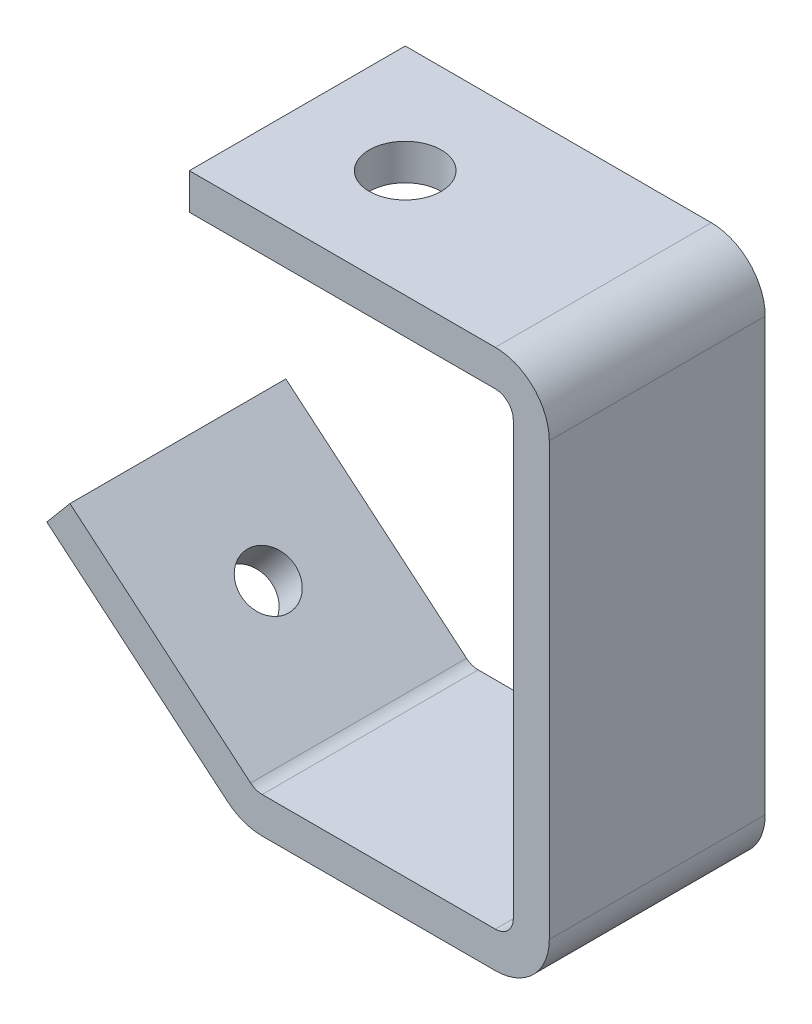
ISO-10303-21;
HEADER;
FILE_DESCRIPTION(('STEP AP214'),'2;1');
FILE_NAME('part.step','',(''),(''),'','','');
FILE_SCHEMA(('AUTOMOTIVE_DESIGN { 1 0 10303 214 1 1 1 1 }'));
ENDSEC;
DATA;
#1=APPLICATION_CONTEXT('core data for automotive mechanical design processes');
#2=APPLICATION_PROTOCOL_DEFINITION('international standard','automotive_design',2000,#1);
#3=PRODUCT_CONTEXT('',#1,'mechanical');
#4=PRODUCT('Part','Part','',(#3));
#5=PRODUCT_RELATED_PRODUCT_CATEGORY('part','',(#4));
#6=PRODUCT_DEFINITION_FORMATION('','',#4);
#7=PRODUCT_DEFINITION_CONTEXT('part definition',#1,'design');
#8=PRODUCT_DEFINITION('design','',#6,#7);
#9=PRODUCT_DEFINITION_SHAPE('','',#8);
#10=(LENGTH_UNIT() NAMED_UNIT(*) SI_UNIT(.MILLI.,.METRE.));
#11=(NAMED_UNIT(*) PLANE_ANGLE_UNIT() SI_UNIT($,.RADIAN.));
#12=(NAMED_UNIT(*) SI_UNIT($,.STERADIAN.) SOLID_ANGLE_UNIT());
#13=UNCERTAINTY_MEASURE_WITH_UNIT(LENGTH_MEASURE(1.E-05),#10,'distance_accuracy_value','');
#14=(GEOMETRIC_REPRESENTATION_CONTEXT(3) GLOBAL_UNCERTAINTY_ASSIGNED_CONTEXT((#13)) GLOBAL_UNIT_ASSIGNED_CONTEXT((#10,
#11,#12)) REPRESENTATION_CONTEXT('',''));
#15=CARTESIAN_POINT('',(0.,0.,0.));
#16=DIRECTION('',(0.,0.,1.));
#17=DIRECTION('',(1.,0.,0.));
#18=AXIS2_PLACEMENT_3D('',#15,#16,#17);
#19=CARTESIAN_POINT('',(-52.6954282662463,-40.5310213291184,38.1));
#20=DIRECTION('',(-0.642787609686535,-0.766044443118982,0.));
#21=DIRECTION('',(0.766044443118982,-0.642787609686535,0.));
#22=AXIS2_PLACEMENT_3D('',#19,#20,#21);
#23=PLANE('',#22);
#24=CARTESIAN_POINT('',(-68.6378577574194,-27.1537346230054,19.05));
#25=DIRECTION('',(-0.642787609686535,-0.766044443118982,0.));
#26=DIRECTION('',(0.766044443118982,-0.642787609686535,0.));
#27=AXIS2_PLACEMENT_3D('',#24,#25,#26);
#28=CIRCLE('',#27,4.765);
#29=CARTESIAN_POINT('',(-64.9876559859574,-30.2166175831617,19.05));
#30=VERTEX_POINT('',#29);
#31=EDGE_CURVE('E370',#30,#30,#28,.T.);
#32=ORIENTED_EDGE('',*,*,#31,.T.);
#33=EDGE_LOOP('',(#32));
#34=FACE_BOUND('',#33,.T.);
#35=DIRECTION('',(-0.766044443118982,0.642787609686535,0.));
#36=VECTOR('',#35,1.);
#37=CARTESIAN_POINT('',(-52.6954282662463,-40.5310213291184,0.));
#38=LINE('',#37,#36);
#39=CARTESIAN_POINT('',(-52.6954282662463,-40.5310213291184,0.));
#40=VERTEX_POINT('',#39);
#41=CARTESIAN_POINT('',(-84.5792426187254,-13.7773244654286,0.));
#42=VERTEX_POINT('',#41);
#43=EDGE_CURVE('E187',#40,#42,#38,.T.);
#44=ORIENTED_EDGE('',*,*,#43,.T.);
#45=DIRECTION('',(0.,0.,-1.));
#46=VECTOR('',#45,1.);
#47=CARTESIAN_POINT('',(-84.5792426187254,-13.7773244654286,38.1));
#48=LINE('',#47,#46);
#49=CARTESIAN_POINT('',(-84.5792426187254,-13.7773244654286,38.1));
#50=VERTEX_POINT('',#49);
#51=EDGE_CURVE('E11',#50,#42,#48,.T.);
#52=ORIENTED_EDGE('',*,*,#51,.F.);
#53=DIRECTION('',(-0.766044443118982,0.642787609686535,0.));
#54=VECTOR('',#53,1.);
#55=CARTESIAN_POINT('',(-52.6954282662463,-40.5310213291184,38.1));
#56=LINE('',#55,#54);
#57=CARTESIAN_POINT('',(-52.6954282662463,-40.5310213291184,38.1));
#58=VERTEX_POINT('',#57);
#59=EDGE_CURVE('E120',#58,#50,#56,.T.);
#60=ORIENTED_EDGE('',*,*,#59,.F.);
#61=DIRECTION('',(0.,0.,-1.));
#62=VECTOR('',#61,1.);
#63=CARTESIAN_POINT('',(-52.6954282662463,-40.5310213291184,38.1));
#64=LINE('',#63,#62);
#65=EDGE_CURVE('E183',#58,#40,#64,.T.);
#66=ORIENTED_EDGE('',*,*,#65,.T.);
#67=EDGE_LOOP('',(#44,#52,#60,#66));
#68=FACE_BOUND('',#67,.T.);
#69=ADVANCED_FACE('F39',(#34,#68),#23,.F.);
#70=CARTESIAN_POINT('',(-88.6609439402349,-18.6417066792342,38.1));
#71=DIRECTION('',(-0.766044443118981,0.642787609686536,0.));
#72=DIRECTION('',(-0.642787609686536,-0.766044443118981,0.));
#73=AXIS2_PLACEMENT_3D('',#70,#71,#72);
#74=PLANE('',#73);
#75=DIRECTION('',(0.642787609686536,0.766044443118981,0.));
#76=VECTOR('',#75,1.);
#77=CARTESIAN_POINT('',(-88.6609439402349,-18.6417066792342,0.));
#78=LINE('',#77,#76);
#79=CARTESIAN_POINT('',(-88.6609439402349,-18.6417066792342,0.));
#80=VERTEX_POINT('',#79);
#81=EDGE_CURVE('E191',#80,#42,#78,.T.);
#82=ORIENTED_EDGE('',*,*,#81,.F.);
#83=DIRECTION('',(0.,0.,-1.));
#84=VECTOR('',#83,1.);
#85=CARTESIAN_POINT('',(-88.6609439402349,-18.6417066792342,38.1));
#86=LINE('',#85,#84);
#87=CARTESIAN_POINT('',(-88.6609439402349,-18.6417066792342,38.1));
#88=VERTEX_POINT('',#87);
#89=EDGE_CURVE('E48',#88,#80,#86,.T.);
#90=ORIENTED_EDGE('',*,*,#89,.F.);
#91=DIRECTION('',(0.642787609686536,0.766044443118981,0.));
#92=VECTOR('',#91,1.);
#93=CARTESIAN_POINT('',(-88.6609439402349,-18.6417066792342,38.1));
#94=LINE('',#93,#92);
#95=EDGE_CURVE('E303',#88,#50,#94,.T.);
#96=ORIENTED_EDGE('',*,*,#95,.T.);
#97=ORIENTED_EDGE('',*,*,#51,.T.);
#98=EDGE_LOOP('',(#82,#90,#96,#97));
#99=FACE_BOUND('',#98,.T.);
#100=ADVANCED_FACE('F290',(#99),#74,.T.);
#101=CARTESIAN_POINT('',(-56.7771295877558,-45.3954035429239,38.1));
#102=DIRECTION('',(-0.642787609686535,-0.766044443118982,0.));
#103=DIRECTION('',(0.766044443118982,-0.642787609686535,0.));
#104=AXIS2_PLACEMENT_3D('',#101,#102,#103);
#105=PLANE('',#104);
#106=CARTESIAN_POINT('',(-72.7195590789289,-32.018116836811,19.05));
#107=DIRECTION('',(-0.642787609686535,-0.766044443118982,0.));
#108=DIRECTION('',(0.766044443118982,-0.642787609686535,0.));
#109=AXIS2_PLACEMENT_3D('',#106,#107,#108);
#110=CIRCLE('',#109,4.765);
#111=CARTESIAN_POINT('',(-69.0693573074669,-35.0809997969673,19.05));
#112=VERTEX_POINT('',#111);
#113=EDGE_CURVE('E374',#112,#112,#110,.T.);
#114=ORIENTED_EDGE('',*,*,#113,.F.);
#115=EDGE_LOOP('',(#114));
#116=FACE_BOUND('',#115,.T.);
#117=DIRECTION('',(-0.766044443118982,0.642787609686535,0.));
#118=VECTOR('',#117,1.);
#119=CARTESIAN_POINT('',(-56.7771295877558,-45.3954035429239,0.));
#120=LINE('',#119,#118);
#121=CARTESIAN_POINT('',(-56.7771295877558,-45.3954035429239,0.));
#122=VERTEX_POINT('',#121);
#123=EDGE_CURVE('E196',#122,#80,#120,.T.);
#124=ORIENTED_EDGE('',*,*,#123,.F.);
#125=DIRECTION('',(0.,0.,-1.));
#126=VECTOR('',#125,1.);
#127=CARTESIAN_POINT('',(-56.7771295877558,-45.3954035429239,38.1));
#128=LINE('',#127,#126);
#129=CARTESIAN_POINT('',(-56.7771295877558,-45.3954035429239,38.1));
#130=VERTEX_POINT('',#129);
#131=EDGE_CURVE('E278',#130,#122,#128,.T.);
#132=ORIENTED_EDGE('',*,*,#131,.F.);
#133=DIRECTION('',(-0.766044443118982,0.642787609686535,0.));
#134=VECTOR('',#133,1.);
#135=CARTESIAN_POINT('',(-56.7771295877558,-45.3954035429239,38.1));
#136=LINE('',#135,#134);
#137=EDGE_CURVE('E287',#130,#88,#136,.T.);
#138=ORIENTED_EDGE('',*,*,#137,.T.);
#139=ORIENTED_EDGE('',*,*,#89,.T.);
#140=EDGE_LOOP('',(#124,#132,#138,#139));
#141=FACE_BOUND('',#140,.T.);
#142=ADVANCED_FACE('F285',(#116,#141),#105,.T.);
#143=CARTESIAN_POINT('',(-50.6513636674431,-38.095,38.1));
#144=DIRECTION('',(0.,0.,-1.));
#145=DIRECTION('',(-1.,0.,0.));
#146=AXIS2_PLACEMENT_3D('',#143,#144,#145);
#147=CYLINDRICAL_SURFACE('',#146,9.53);
#148=CARTESIAN_POINT('',(-50.6513636674431,-38.095,0.));
#149=DIRECTION('',(0.,0.,-1.));
#150=DIRECTION('',(1.,0.,0.));
#151=AXIS2_PLACEMENT_3D('',#148,#149,#150);
#152=CIRCLE('',#151,9.53);
#153=CARTESIAN_POINT('',(-50.6513636674431,-47.625,0.));
#154=VERTEX_POINT('',#153);
#155=EDGE_CURVE('E200',#154,#122,#152,.T.);
#156=ORIENTED_EDGE('',*,*,#155,.F.);
#157=DIRECTION('',(0.,0.,-1.));
#158=VECTOR('',#157,1.);
#159=CARTESIAN_POINT('',(-50.6513636674431,-47.625,38.1));
#160=LINE('',#159,#158);
#161=CARTESIAN_POINT('',(-50.6513636674431,-47.625,38.1));
#162=VERTEX_POINT('',#161);
#163=EDGE_CURVE('E275',#162,#154,#160,.T.);
#164=ORIENTED_EDGE('',*,*,#163,.F.);
#165=CARTESIAN_POINT('',(-50.6513636674431,-38.095,38.1));
#166=DIRECTION('',(0.,0.,-1.));
#167=DIRECTION('',(1.,0.,0.));
#168=AXIS2_PLACEMENT_3D('',#165,#166,#167);
#169=CIRCLE('',#168,9.53);
#170=EDGE_CURVE('E300',#162,#130,#169,.T.);
#171=ORIENTED_EDGE('',*,*,#170,.T.);
#172=ORIENTED_EDGE('',*,*,#131,.T.);
#173=EDGE_LOOP('',(#156,#164,#171,#172));
#174=FACE_BOUND('',#173,.T.);
#175=ADVANCED_FACE('F297',(#174),#147,.T.);
#176=CARTESIAN_POINT('',(-50.6513636674431,-47.625,38.1));
#177=DIRECTION('',(0.,-1.,0.));
#178=DIRECTION('',(1.,0.,0.));
#179=AXIS2_PLACEMENT_3D('',#176,#177,#178);
#180=PLANE('',#179);
#181=DIRECTION('',(-1.,0.,0.));
#182=VECTOR('',#181,1.);
#183=CARTESIAN_POINT('',(-50.6513636674431,-47.625,0.));
#184=LINE('',#183,#182);
#185=CARTESIAN_POINT('',(-9.51999999999998,-47.625,0.));
#186=VERTEX_POINT('',#185);
#187=EDGE_CURVE('E204',#186,#154,#184,.T.);
#188=ORIENTED_EDGE('',*,*,#187,.F.);
#189=DIRECTION('',(0.,0.,-1.));
#190=VECTOR('',#189,1.);
#191=CARTESIAN_POINT('',(-9.51999999999998,-47.625,38.1));
#192=LINE('',#191,#190);
#193=CARTESIAN_POINT('',(-9.51999999999998,-47.625,38.1));
#194=VERTEX_POINT('',#193);
#195=EDGE_CURVE('E272',#194,#186,#192,.T.);
#196=ORIENTED_EDGE('',*,*,#195,.F.);
#197=DIRECTION('',(-1.,0.,0.));
#198=VECTOR('',#197,1.);
#199=CARTESIAN_POINT('',(-50.6513636674431,-47.625,38.1));
#200=LINE('',#199,#198);
#201=EDGE_CURVE('E308',#194,#162,#200,.T.);
#202=ORIENTED_EDGE('',*,*,#201,.T.);
#203=ORIENTED_EDGE('',*,*,#163,.T.);
#204=EDGE_LOOP('',(#188,#196,#202,#203));
#205=FACE_BOUND('',#204,.T.);
#206=ADVANCED_FACE('F421',(#205),#180,.T.);
#207=CARTESIAN_POINT('',(-9.51999999999998,-38.105,38.1));
#208=DIRECTION('',(0.,0.,-1.));
#209=DIRECTION('',(-1.,0.,0.));
#210=AXIS2_PLACEMENT_3D('',#207,#208,#209);
#211=CYLINDRICAL_SURFACE('',#210,9.52);
#212=CARTESIAN_POINT('',(-9.51999999999998,-38.105,0.));
#213=DIRECTION('',(0.,0.,-1.));
#214=DIRECTION('',(1.,0.,0.));
#215=AXIS2_PLACEMENT_3D('',#212,#213,#214);
#216=CIRCLE('',#215,9.52);
#217=CARTESIAN_POINT('',(0.,-38.105,0.));
#218=VERTEX_POINT('',#217);
#219=EDGE_CURVE('E208',#218,#186,#216,.T.);
#220=ORIENTED_EDGE('',*,*,#219,.F.);
#221=DIRECTION('',(0.,0.,-1.));
#222=VECTOR('',#221,1.);
#223=CARTESIAN_POINT('',(0.,-38.105,38.1));
#224=LINE('',#223,#222);
#225=CARTESIAN_POINT('',(0.,-38.105,38.1));
#226=VERTEX_POINT('',#225);
#227=EDGE_CURVE('E269',#226,#218,#224,.T.);
#228=ORIENTED_EDGE('',*,*,#227,.F.);
#229=CARTESIAN_POINT('',(-9.51999999999998,-38.105,38.1));
#230=DIRECTION('',(0.,0.,-1.));
#231=DIRECTION('',(1.,0.,0.));
#232=AXIS2_PLACEMENT_3D('',#229,#230,#231);
#233=CIRCLE('',#232,9.52);
#234=EDGE_CURVE('E315',#226,#194,#233,.T.);
#235=ORIENTED_EDGE('',*,*,#234,.T.);
#236=ORIENTED_EDGE('',*,*,#195,.T.);
#237=EDGE_LOOP('',(#220,#228,#235,#236));
#238=FACE_BOUND('',#237,.T.);
#239=ADVANCED_FACE('F419',(#238),#211,.T.);
#240=CARTESIAN_POINT('',(0.,38.105,38.1));
#241=DIRECTION('',(1.,0.,0.));
#242=DIRECTION('',(0.,1.,0.));
#243=AXIS2_PLACEMENT_3D('',#240,#241,#242);
#244=PLANE('',#243);
#245=DIRECTION('',(0.,-1.,0.));
#246=VECTOR('',#245,1.);
#247=CARTESIAN_POINT('',(0.,38.105,0.));
#248=LINE('',#247,#246);
#249=CARTESIAN_POINT('',(0.,38.105,0.));
#250=VERTEX_POINT('',#249);
#251=EDGE_CURVE('E212',#250,#218,#248,.T.);
#252=ORIENTED_EDGE('',*,*,#251,.F.);
#253=DIRECTION('',(0.,0.,-1.));
#254=VECTOR('',#253,1.);
#255=CARTESIAN_POINT('',(0.,38.105,38.1));
#256=LINE('',#255,#254);
#257=CARTESIAN_POINT('',(0.,38.105,38.1));
#258=VERTEX_POINT('',#257);
#259=EDGE_CURVE('E266',#258,#250,#256,.T.);
#260=ORIENTED_EDGE('',*,*,#259,.F.);
#261=DIRECTION('',(0.,-1.,0.));
#262=VECTOR('',#261,1.);
#263=CARTESIAN_POINT('',(0.,38.105,38.1));
#264=LINE('',#263,#262);
#265=EDGE_CURVE('E319',#258,#226,#264,.T.);
#266=ORIENTED_EDGE('',*,*,#265,.T.);
#267=ORIENTED_EDGE('',*,*,#227,.T.);
#268=EDGE_LOOP('',(#252,#260,#266,#267));
#269=FACE_BOUND('',#268,.T.);
#270=ADVANCED_FACE('F417',(#269),#244,.T.);
#271=CARTESIAN_POINT('',(-9.52,38.105,38.1));
#272=DIRECTION('',(0.,0.,-1.));
#273=DIRECTION('',(-1.,0.,0.));
#274=AXIS2_PLACEMENT_3D('',#271,#272,#273);
#275=CYLINDRICAL_SURFACE('',#274,9.52);
#276=CARTESIAN_POINT('',(-9.52,38.105,0.));
#277=DIRECTION('',(0.,0.,-1.));
#278=DIRECTION('',(1.,0.,0.));
#279=AXIS2_PLACEMENT_3D('',#276,#277,#278);
#280=CIRCLE('',#279,9.52);
#281=CARTESIAN_POINT('',(-9.52000000000001,47.625,0.));
#282=VERTEX_POINT('',#281);
#283=EDGE_CURVE('E216',#282,#250,#280,.T.);
#284=ORIENTED_EDGE('',*,*,#283,.F.);
#285=DIRECTION('',(0.,0.,-1.));
#286=VECTOR('',#285,1.);
#287=CARTESIAN_POINT('',(-9.52000000000001,47.625,38.1));
#288=LINE('',#287,#286);
#289=CARTESIAN_POINT('',(-9.52000000000001,47.625,38.1));
#290=VERTEX_POINT('',#289);
#291=EDGE_CURVE('E263',#290,#282,#288,.T.);
#292=ORIENTED_EDGE('',*,*,#291,.F.);
#293=CARTESIAN_POINT('',(-9.52,38.105,38.1));
#294=DIRECTION('',(0.,0.,-1.));
#295=DIRECTION('',(1.,0.,0.));
#296=AXIS2_PLACEMENT_3D('',#293,#294,#295);
#297=CIRCLE('',#296,9.52);
#298=EDGE_CURVE('E323',#290,#258,#297,.T.);
#299=ORIENTED_EDGE('',*,*,#298,.T.);
#300=ORIENTED_EDGE('',*,*,#259,.T.);
#301=EDGE_LOOP('',(#284,#292,#299,#300));
#302=FACE_BOUND('',#301,.T.);
#303=ADVANCED_FACE('F402',(#302),#275,.T.);
#304=CARTESIAN_POINT('',(-63.51,47.625,38.1));
#305=DIRECTION('',(0.,1.,0.));
#306=DIRECTION('',(-1.,0.,0.));
#307=AXIS2_PLACEMENT_3D('',#304,#305,#306);
#308=PLANE('',#307);
#309=CARTESIAN_POINT('',(-44.47,47.625,19.05));
#310=DIRECTION('',(0.,1.,0.));
#311=DIRECTION('',(0.,0.,1.));
#312=AXIS2_PLACEMENT_3D('',#309,#310,#311);
#313=CIRCLE('',#312,6.35);
#314=CARTESIAN_POINT('',(-44.47,47.625,25.4));
#315=VERTEX_POINT('',#314);
#316=EDGE_CURVE('E373',#315,#315,#313,.T.);
#317=ORIENTED_EDGE('',*,*,#316,.F.);
#318=EDGE_LOOP('',(#317));
#319=FACE_BOUND('',#318,.T.);
#320=DIRECTION('',(1.,0.,0.));
#321=VECTOR('',#320,1.);
#322=CARTESIAN_POINT('',(-63.51,47.625,0.));
#323=LINE('',#322,#321);
#324=CARTESIAN_POINT('',(-63.51,47.625,0.));
#325=VERTEX_POINT('',#324);
#326=EDGE_CURVE('E220',#325,#282,#323,.T.);
#327=ORIENTED_EDGE('',*,*,#326,.F.);
#328=DIRECTION('',(0.,0.,-1.));
#329=VECTOR('',#328,1.);
#330=CARTESIAN_POINT('',(-63.51,47.625,38.1));
#331=LINE('',#330,#329);
#332=CARTESIAN_POINT('',(-63.51,47.625,38.1));
#333=VERTEX_POINT('',#332);
#334=EDGE_CURVE('E260',#333,#325,#331,.T.);
#335=ORIENTED_EDGE('',*,*,#334,.F.);
#336=DIRECTION('',(1.,0.,0.));
#337=VECTOR('',#336,1.);
#338=CARTESIAN_POINT('',(-63.51,47.625,38.1));
#339=LINE('',#338,#337);
#340=EDGE_CURVE('E327',#333,#290,#339,.T.);
#341=ORIENTED_EDGE('',*,*,#340,.T.);
#342=ORIENTED_EDGE('',*,*,#291,.T.);
#343=EDGE_LOOP('',(#327,#335,#341,#342));
#344=FACE_BOUND('',#343,.T.);
#345=ADVANCED_FACE('F398',(#319,#344),#308,.T.);
#346=CARTESIAN_POINT('',(-63.51,41.275,38.1));
#347=DIRECTION('',(-1.,0.,0.));
#348=DIRECTION('',(0.,0.,1.));
#349=AXIS2_PLACEMENT_3D('',#346,#347,#348);
#350=PLANE('',#349);
#351=DIRECTION('',(0.,1.,0.));
#352=VECTOR('',#351,1.);
#353=CARTESIAN_POINT('',(-63.51,41.275,0.));
#354=LINE('',#353,#352);
#355=CARTESIAN_POINT('',(-63.51,41.275,0.));
#356=VERTEX_POINT('',#355);
#357=EDGE_CURVE('E224',#356,#325,#354,.T.);
#358=ORIENTED_EDGE('',*,*,#357,.F.);
#359=DIRECTION('',(0.,0.,-1.));
#360=VECTOR('',#359,1.);
#361=CARTESIAN_POINT('',(-63.51,41.275,38.1));
#362=LINE('',#361,#360);
#363=CARTESIAN_POINT('',(-63.51,41.275,38.1));
#364=VERTEX_POINT('',#363);
#365=EDGE_CURVE('E257',#364,#356,#362,.T.);
#366=ORIENTED_EDGE('',*,*,#365,.F.);
#367=DIRECTION('',(0.,1.,0.));
#368=VECTOR('',#367,1.);
#369=CARTESIAN_POINT('',(-63.51,41.275,38.1));
#370=LINE('',#369,#368);
#371=EDGE_CURVE('E331',#364,#333,#370,.T.);
#372=ORIENTED_EDGE('',*,*,#371,.T.);
#373=ORIENTED_EDGE('',*,*,#334,.T.);
#374=EDGE_LOOP('',(#358,#366,#372,#373));
#375=FACE_BOUND('',#374,.T.);
#376=ADVANCED_FACE('F401',(#375),#350,.T.);
#377=CARTESIAN_POINT('',(-63.51,41.275,38.1));
#378=DIRECTION('',(0.,1.,0.));
#379=DIRECTION('',(-1.,0.,0.));
#380=AXIS2_PLACEMENT_3D('',#377,#378,#379);
#381=PLANE('',#380);
#382=CARTESIAN_POINT('',(-44.47,41.275,19.05));
#383=DIRECTION('',(0.,1.,0.));
#384=DIRECTION('',(0.,0.,1.));
#385=AXIS2_PLACEMENT_3D('',#382,#383,#384);
#386=CIRCLE('',#385,6.34999999999999);
#387=CARTESIAN_POINT('',(-44.47,41.275,25.4));
#388=VERTEX_POINT('',#387);
#389=EDGE_CURVE('E192',#388,#388,#386,.T.);
#390=ORIENTED_EDGE('',*,*,#389,.T.);
#391=EDGE_LOOP('',(#390));
#392=FACE_BOUND('',#391,.T.);
#393=DIRECTION('',(1.,0.,0.));
#394=VECTOR('',#393,1.);
#395=CARTESIAN_POINT('',(-63.51,41.275,0.));
#396=LINE('',#395,#394);
#397=CARTESIAN_POINT('',(-9.52,41.275,0.));
#398=VERTEX_POINT('',#397);
#399=EDGE_CURVE('E228',#356,#398,#396,.T.);
#400=ORIENTED_EDGE('',*,*,#399,.T.);
#401=DIRECTION('',(0.,0.,-1.));
#402=VECTOR('',#401,1.);
#403=CARTESIAN_POINT('',(-9.52,41.275,38.1));
#404=LINE('',#403,#402);
#405=CARTESIAN_POINT('',(-9.52,41.275,38.1));
#406=VERTEX_POINT('',#405);
#407=EDGE_CURVE('E253',#406,#398,#404,.T.);
#408=ORIENTED_EDGE('',*,*,#407,.F.);
#409=DIRECTION('',(1.,0.,0.));
#410=VECTOR('',#409,1.);
#411=CARTESIAN_POINT('',(-63.51,41.275,38.1));
#412=LINE('',#411,#410);
#413=EDGE_CURVE('E335',#364,#406,#412,.T.);
#414=ORIENTED_EDGE('',*,*,#413,.F.);
#415=ORIENTED_EDGE('',*,*,#365,.T.);
#416=EDGE_LOOP('',(#400,#408,#414,#415));
#417=FACE_BOUND('',#416,.T.);
#418=ADVANCED_FACE('F388',(#392,#417),#381,.F.);
#419=CARTESIAN_POINT('',(-9.52,38.105,38.1));
#420=DIRECTION('',(0.,0.,-1.));
#421=DIRECTION('',(-1.,0.,0.));
#422=AXIS2_PLACEMENT_3D('',#419,#420,#421);
#423=CYLINDRICAL_SURFACE('',#422,3.17);
#424=CARTESIAN_POINT('',(-9.52,38.105,0.));
#425=DIRECTION('',(0.,0.,1.));
#426=DIRECTION('',(1.,0.,0.));
#427=AXIS2_PLACEMENT_3D('',#424,#425,#426);
#428=CIRCLE('',#427,3.17);
#429=CARTESIAN_POINT('',(-6.35000000000001,38.105,0.));
#430=VERTEX_POINT('',#429);
#431=EDGE_CURVE('E231',#398,#430,#428,.F.);
#432=ORIENTED_EDGE('',*,*,#431,.T.);
#433=DIRECTION('',(0.,0.,-1.));
#434=VECTOR('',#433,1.);
#435=CARTESIAN_POINT('',(-6.35000000000001,38.105,38.1));
#436=LINE('',#435,#434);
#437=CARTESIAN_POINT('',(-6.35000000000001,38.105,38.1));
#438=VERTEX_POINT('',#437);
#439=EDGE_CURVE('E249',#438,#430,#436,.T.);
#440=ORIENTED_EDGE('',*,*,#439,.F.);
#441=CARTESIAN_POINT('',(-9.52,38.105,38.1));
#442=DIRECTION('',(0.,0.,1.));
#443=DIRECTION('',(1.,0.,0.));
#444=AXIS2_PLACEMENT_3D('',#441,#442,#443);
#445=CIRCLE('',#444,3.17);
#446=EDGE_CURVE('E338',#406,#438,#445,.F.);
#447=ORIENTED_EDGE('',*,*,#446,.F.);
#448=ORIENTED_EDGE('',*,*,#407,.T.);
#449=EDGE_LOOP('',(#432,#440,#447,#448));
#450=FACE_BOUND('',#449,.T.);
#451=ADVANCED_FACE('F347',(#450),#423,.F.);
#452=CARTESIAN_POINT('',(-6.35000000000001,38.105,38.1));
#453=DIRECTION('',(1.,0.,0.));
#454=DIRECTION('',(0.,1.,0.));
#455=AXIS2_PLACEMENT_3D('',#452,#453,#454);
#456=PLANE('',#455);
#457=DIRECTION('',(0.,-1.,0.));
#458=VECTOR('',#457,1.);
#459=CARTESIAN_POINT('',(-6.35000000000001,38.105,0.));
#460=LINE('',#459,#458);
#461=CARTESIAN_POINT('',(-6.34999999999998,-38.105,0.));
#462=VERTEX_POINT('',#461);
#463=EDGE_CURVE('E234',#430,#462,#460,.T.);
#464=ORIENTED_EDGE('',*,*,#463,.T.);
#465=DIRECTION('',(0.,0.,-1.));
#466=VECTOR('',#465,1.);
#467=CARTESIAN_POINT('',(-6.34999999999998,-38.105,38.1));
#468=LINE('',#467,#466);
#469=CARTESIAN_POINT('',(-6.34999999999998,-38.105,38.1));
#470=VERTEX_POINT('',#469);
#471=EDGE_CURVE('E176',#470,#462,#468,.T.);
#472=ORIENTED_EDGE('',*,*,#471,.F.);
#473=DIRECTION('',(0.,-1.,0.));
#474=VECTOR('',#473,1.);
#475=CARTESIAN_POINT('',(-6.35000000000001,38.105,38.1));
#476=LINE('',#475,#474);
#477=EDGE_CURVE('E165',#438,#470,#476,.T.);
#478=ORIENTED_EDGE('',*,*,#477,.F.);
#479=ORIENTED_EDGE('',*,*,#439,.T.);
#480=EDGE_LOOP('',(#464,#472,#478,#479));
#481=FACE_BOUND('',#480,.T.);
#482=ADVANCED_FACE('F351',(#481),#456,.F.);
#483=CARTESIAN_POINT('',(-9.51999999999998,-38.105,38.1));
#484=DIRECTION('',(0.,0.,-1.));
#485=DIRECTION('',(-1.,0.,0.));
#486=AXIS2_PLACEMENT_3D('',#483,#484,#485);
#487=CYLINDRICAL_SURFACE('',#486,3.17);
#488=CARTESIAN_POINT('',(-9.51999999999998,-38.105,0.));
#489=DIRECTION('',(0.,0.,1.));
#490=DIRECTION('',(1.,0.,0.));
#491=AXIS2_PLACEMENT_3D('',#488,#489,#490);
#492=CIRCLE('',#491,3.17);
#493=CARTESIAN_POINT('',(-9.51999999999998,-41.275,0.));
#494=VERTEX_POINT('',#493);
#495=EDGE_CURVE('E174',#462,#494,#492,.F.);
#496=ORIENTED_EDGE('',*,*,#495,.T.);
#497=DIRECTION('',(0.,0.,-1.));
#498=VECTOR('',#497,1.);
#499=CARTESIAN_POINT('',(-9.51999999999998,-41.275,38.1));
#500=LINE('',#499,#498);
#501=CARTESIAN_POINT('',(-9.51999999999998,-41.275,38.1));
#502=VERTEX_POINT('',#501);
#503=EDGE_CURVE('E171',#502,#494,#500,.T.);
#504=ORIENTED_EDGE('',*,*,#503,.F.);
#505=CARTESIAN_POINT('',(-9.51999999999998,-38.105,38.1));
#506=DIRECTION('',(0.,0.,1.));
#507=DIRECTION('',(1.,0.,0.));
#508=AXIS2_PLACEMENT_3D('',#505,#506,#507);
#509=CIRCLE('',#508,3.17);
#510=EDGE_CURVE('E159',#470,#502,#509,.F.);
#511=ORIENTED_EDGE('',*,*,#510,.F.);
#512=ORIENTED_EDGE('',*,*,#471,.T.);
#513=EDGE_LOOP('',(#496,#504,#511,#512));
#514=FACE_BOUND('',#513,.T.);
#515=ADVANCED_FACE('F172',(#514),#487,.F.);
#516=CARTESIAN_POINT('',(-50.6513636674431,-41.275,38.1));
#517=DIRECTION('',(0.,-1.,0.));
#518=DIRECTION('',(1.,0.,0.));
#519=AXIS2_PLACEMENT_3D('',#516,#517,#518);
#520=PLANE('',#519);
#521=DIRECTION('',(-1.,0.,0.));
#522=VECTOR('',#521,1.);
#523=CARTESIAN_POINT('',(-50.6513636674431,-41.275,0.));
#524=LINE('',#523,#522);
#525=CARTESIAN_POINT('',(-50.6513636674431,-41.275,0.));
#526=VERTEX_POINT('',#525);
#527=EDGE_CURVE('E108',#494,#526,#524,.T.);
#528=ORIENTED_EDGE('',*,*,#527,.T.);
#529=DIRECTION('',(0.,0.,-1.));
#530=VECTOR('',#529,1.);
#531=CARTESIAN_POINT('',(-50.6513636674431,-41.275,38.1));
#532=LINE('',#531,#530);
#533=CARTESIAN_POINT('',(-50.6513636674431,-41.275,38.1));
#534=VERTEX_POINT('',#533);
#535=EDGE_CURVE('E177',#534,#526,#532,.T.);
#536=ORIENTED_EDGE('',*,*,#535,.F.);
#537=DIRECTION('',(-1.,0.,0.));
#538=VECTOR('',#537,1.);
#539=CARTESIAN_POINT('',(-50.6513636674431,-41.275,38.1));
#540=LINE('',#539,#538);
#541=EDGE_CURVE('E163',#502,#534,#540,.T.);
#542=ORIENTED_EDGE('',*,*,#541,.F.);
#543=ORIENTED_EDGE('',*,*,#503,.T.);
#544=EDGE_LOOP('',(#528,#536,#542,#543));
#545=FACE_BOUND('',#544,.T.);
#546=ADVANCED_FACE('F179',(#545),#520,.F.);
#547=CARTESIAN_POINT('',(-50.6513636674431,-38.095,38.1));
#548=DIRECTION('',(0.,0.,-1.));
#549=DIRECTION('',(-1.,0.,0.));
#550=AXIS2_PLACEMENT_3D('',#547,#548,#549);
#551=CYLINDRICAL_SURFACE('',#550,3.18);
#552=CARTESIAN_POINT('',(-50.6513636674431,-38.095,0.));
#553=DIRECTION('',(0.,0.,1.));
#554=DIRECTION('',(1.,0.,0.));
#555=AXIS2_PLACEMENT_3D('',#552,#553,#554);
#556=CIRCLE('',#555,3.18);
#557=EDGE_CURVE('E114',#526,#40,#556,.F.);
#558=ORIENTED_EDGE('',*,*,#557,.T.);
#559=ORIENTED_EDGE('',*,*,#65,.F.);
#560=CARTESIAN_POINT('',(-50.6513636674431,-38.095,38.1));
#561=DIRECTION('',(0.,0.,1.));
#562=DIRECTION('',(1.,0.,0.));
#563=AXIS2_PLACEMENT_3D('',#560,#561,#562);
#564=CIRCLE('',#563,3.18);
#565=EDGE_CURVE('E56',#534,#58,#564,.F.);
#566=ORIENTED_EDGE('',*,*,#565,.F.);
#567=ORIENTED_EDGE('',*,*,#535,.T.);
#568=EDGE_LOOP('',(#558,#559,#566,#567));
#569=FACE_BOUND('',#568,.T.);
#570=ADVANCED_FACE('F353',(#569),#551,.F.);
#571=CARTESIAN_POINT('',(-50.6513636674431,-38.095,38.1));
#572=DIRECTION('',(0.,0.,-1.));
#573=DIRECTION('',(-1.,0.,0.));
#574=AXIS2_PLACEMENT_3D('',#571,#572,#573);
#575=PLANE('',#574);
#576=ORIENTED_EDGE('',*,*,#59,.T.);
#577=ORIENTED_EDGE('',*,*,#95,.F.);
#578=ORIENTED_EDGE('',*,*,#137,.F.);
#579=ORIENTED_EDGE('',*,*,#170,.F.);
#580=ORIENTED_EDGE('',*,*,#201,.F.);
#581=ORIENTED_EDGE('',*,*,#234,.F.);
#582=ORIENTED_EDGE('',*,*,#265,.F.);
#583=ORIENTED_EDGE('',*,*,#298,.F.);
#584=ORIENTED_EDGE('',*,*,#340,.F.);
#585=ORIENTED_EDGE('',*,*,#371,.F.);
#586=ORIENTED_EDGE('',*,*,#413,.T.);
#587=ORIENTED_EDGE('',*,*,#446,.T.);
#588=ORIENTED_EDGE('',*,*,#477,.T.);
#589=ORIENTED_EDGE('',*,*,#510,.T.);
#590=ORIENTED_EDGE('',*,*,#541,.T.);
#591=ORIENTED_EDGE('',*,*,#565,.T.);
#592=EDGE_LOOP('',(#576,#577,#578,#579,#580,#581,#582,#583,#584,#585,#586,#587,#588,#589,#590,#591));
#593=FACE_BOUND('',#592,.T.);
#594=ADVANCED_FACE('F161',(#593),#575,.F.);
#595=CARTESIAN_POINT('',(-50.6513636674431,-38.095,0.));
#596=DIRECTION('',(0.,0.,-1.));
#597=DIRECTION('',(-1.,0.,0.));
#598=AXIS2_PLACEMENT_3D('',#595,#596,#597);
#599=PLANE('',#598);
#600=ORIENTED_EDGE('',*,*,#43,.F.);
#601=ORIENTED_EDGE('',*,*,#557,.F.);
#602=ORIENTED_EDGE('',*,*,#527,.F.);
#603=ORIENTED_EDGE('',*,*,#495,.F.);
#604=ORIENTED_EDGE('',*,*,#463,.F.);
#605=ORIENTED_EDGE('',*,*,#431,.F.);
#606=ORIENTED_EDGE('',*,*,#399,.F.);
#607=ORIENTED_EDGE('',*,*,#357,.T.);
#608=ORIENTED_EDGE('',*,*,#326,.T.);
#609=ORIENTED_EDGE('',*,*,#283,.T.);
#610=ORIENTED_EDGE('',*,*,#251,.T.);
#611=ORIENTED_EDGE('',*,*,#219,.T.);
#612=ORIENTED_EDGE('',*,*,#187,.T.);
#613=ORIENTED_EDGE('',*,*,#155,.T.);
#614=ORIENTED_EDGE('',*,*,#123,.T.);
#615=ORIENTED_EDGE('',*,*,#81,.T.);
#616=EDGE_LOOP('',(#600,#601,#602,#603,#604,#605,#606,#607,#608,#609,#610,#611,#612,#613,#614,#615));
#617=FACE_BOUND('',#616,.T.);
#618=ADVANCED_FACE('F293',(#617),#599,.T.);
#619=CARTESIAN_POINT('',(-44.47,47.625,19.05));
#620=DIRECTION('',(0.,1.,0.));
#621=DIRECTION('',(0.,0.,1.));
#622=AXIS2_PLACEMENT_3D('',#619,#620,#621);
#623=CYLINDRICAL_SURFACE('',#622,6.35);
#624=ORIENTED_EDGE('',*,*,#389,.F.);
#625=EDGE_LOOP('',(#624));
#626=FACE_BOUND('',#625,.T.);
#627=ORIENTED_EDGE('',*,*,#316,.T.);
#628=EDGE_LOOP('',(#627));
#629=FACE_BOUND('',#628,.T.);
#630=ADVANCED_FACE('F391',(#626,#629),#623,.F.);
#631=CARTESIAN_POINT('',(-72.7195590789289,-32.018116836811,19.05));
#632=DIRECTION('',(-0.642787609686535,-0.766044443118982,0.));
#633=DIRECTION('',(0.766044443118982,-0.642787609686535,0.));
#634=AXIS2_PLACEMENT_3D('',#631,#632,#633);
#635=CYLINDRICAL_SURFACE('',#634,4.765);
#636=ORIENTED_EDGE('',*,*,#31,.F.);
#637=EDGE_LOOP('',(#636));
#638=FACE_BOUND('',#637,.T.);
#639=ORIENTED_EDGE('',*,*,#113,.T.);
#640=EDGE_LOOP('',(#639));
#641=FACE_BOUND('',#640,.T.);
#642=ADVANCED_FACE('F394',(#638,#641),#635,.F.);
#643=CLOSED_SHELL('',(#69,#100,#142,#175,#206,#239,#270,#303,#345,#376,#418,#451,#482,#515,#546,
#570,#594,#618,#630,#642));
#644=MANIFOLD_SOLID_BREP('B2',#643);
#645=ADVANCED_BREP_SHAPE_REPRESENTATION('',(#18,#644),#14);
#646=SHAPE_DEFINITION_REPRESENTATION(#9,#645);
ENDSEC;
END-ISO-10303-21;
